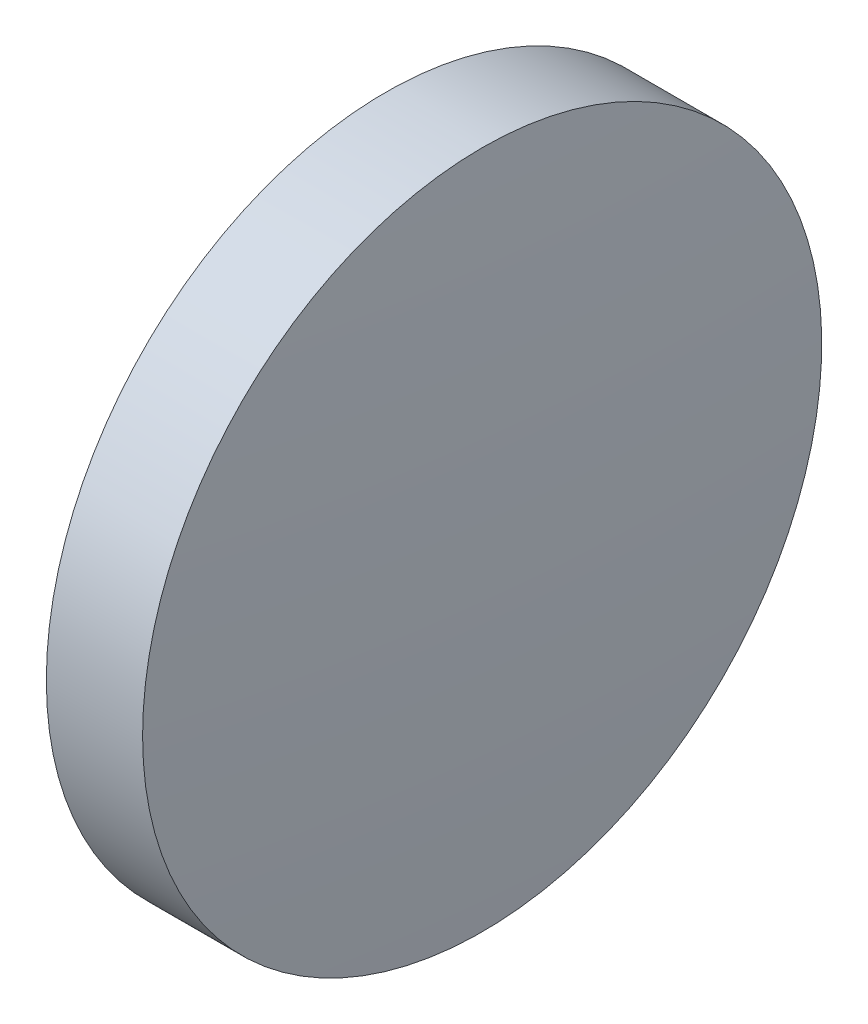
ISO-10303-21;
HEADER;
FILE_DESCRIPTION(('STEP AP214'),'2;1');
FILE_NAME('part.step','',(''),(''),'','','');
FILE_SCHEMA(('AUTOMOTIVE_DESIGN { 1 0 10303 214 1 1 1 1 }'));
ENDSEC;
DATA;
#1=APPLICATION_CONTEXT('core data for automotive mechanical design processes');
#2=APPLICATION_PROTOCOL_DEFINITION('international standard','automotive_design',2000,#1);
#3=PRODUCT_CONTEXT('',#1,'mechanical');
#4=PRODUCT('Part','Part','',(#3));
#5=PRODUCT_RELATED_PRODUCT_CATEGORY('part','',(#4));
#6=PRODUCT_DEFINITION_FORMATION('','',#4);
#7=PRODUCT_DEFINITION_CONTEXT('part definition',#1,'design');
#8=PRODUCT_DEFINITION('design','',#6,#7);
#9=PRODUCT_DEFINITION_SHAPE('','',#8);
#10=(LENGTH_UNIT() NAMED_UNIT(*) SI_UNIT(.MILLI.,.METRE.));
#11=(NAMED_UNIT(*) PLANE_ANGLE_UNIT() SI_UNIT($,.RADIAN.));
#12=(NAMED_UNIT(*) SI_UNIT($,.STERADIAN.) SOLID_ANGLE_UNIT());
#13=UNCERTAINTY_MEASURE_WITH_UNIT(LENGTH_MEASURE(1.E-05),#10,'distance_accuracy_value','');
#14=(GEOMETRIC_REPRESENTATION_CONTEXT(3) GLOBAL_UNCERTAINTY_ASSIGNED_CONTEXT((#13)) GLOBAL_UNIT_ASSIGNED_CONTEXT((#10,
#11,#12)) REPRESENTATION_CONTEXT('',''));
#15=CARTESIAN_POINT('',(0.,0.,0.));
#16=DIRECTION('',(0.,0.,1.));
#17=DIRECTION('',(1.,0.,0.));
#18=AXIS2_PLACEMENT_3D('',#15,#16,#17);
#19=CARTESIAN_POINT('',(-82.0479445237923,65.233554926412,0.));
#20=DIRECTION('',(-1.,0.,0.));
#21=DIRECTION('',(0.,1.,0.));
#22=AXIS2_PLACEMENT_3D('',#19,#20,#21);
#23=SPHERICAL_SURFACE('',#22,201.812499999994);
#24=CARTESIAN_POINT('',(119.364555476201,65.2335549264122,0.));
#25=DIRECTION('',(-1.,0.,0.));
#26=DIRECTION('',(0.,0.,1.));
#27=AXIS2_PLACEMENT_3D('',#24,#25,#26);
#28=CIRCLE('',#27,12.7);
#29=CARTESIAN_POINT('',(119.364555476201,65.2335549264122,12.7));
#30=VERTEX_POINT('',#29);
#31=EDGE_CURVE('E10',#30,#30,#28,.T.);
#32=ORIENTED_EDGE('',*,*,#31,.F.);
#33=EDGE_LOOP('',(#32));
#34=FACE_BOUND('',#33,.T.);
#35=ADVANCED_FACE('F35',(#34),#23,.T.);
#36=CARTESIAN_POINT('',(110.165373228488,65.2335549264122,0.));
#37=DIRECTION('',(-1.,0.,0.));
#38=DIRECTION('',(0.,0.,1.));
#39=AXIS2_PLACEMENT_3D('',#36,#37,#38);
#40=CYLINDRICAL_SURFACE('',#39,12.7);
#41=CARTESIAN_POINT('',(115.764555476201,65.2335549264122,0.));
#42=DIRECTION('',(-1.,0.,0.));
#43=DIRECTION('',(0.,0.,1.));
#44=AXIS2_PLACEMENT_3D('',#41,#42,#43);
#45=CIRCLE('',#44,12.7);
#46=CARTESIAN_POINT('',(115.764555476201,65.2335549264122,12.7));
#47=VERTEX_POINT('',#46);
#48=EDGE_CURVE('E41',#47,#47,#45,.T.);
#49=ORIENTED_EDGE('',*,*,#48,.F.);
#50=EDGE_LOOP('',(#49));
#51=FACE_BOUND('',#50,.T.);
#52=ORIENTED_EDGE('',*,*,#31,.T.);
#53=EDGE_LOOP('',(#52));
#54=FACE_BOUND('',#53,.T.);
#55=ADVANCED_FACE('F49',(#51,#54),#40,.T.);
#56=CARTESIAN_POINT('',(115.764555476201,65.2335549264122,0.));
#57=DIRECTION('',(1.,0.,0.));
#58=DIRECTION('',(0.,0.,-1.));
#59=AXIS2_PLACEMENT_3D('',#56,#57,#58);
#60=PLANE('',#59);
#61=ORIENTED_EDGE('',*,*,#48,.T.);
#62=EDGE_LOOP('',(#61));
#63=FACE_BOUND('',#62,.T.);
#64=ADVANCED_FACE('F47',(#63),#60,.F.);
#65=CLOSED_SHELL('',(#35,#55,#64));
#66=MANIFOLD_SOLID_BREP('B2',#65);
#67=ADVANCED_BREP_SHAPE_REPRESENTATION('',(#18,#66),#14);
#68=SHAPE_DEFINITION_REPRESENTATION(#9,#67);
ENDSEC;
END-ISO-10303-21;
